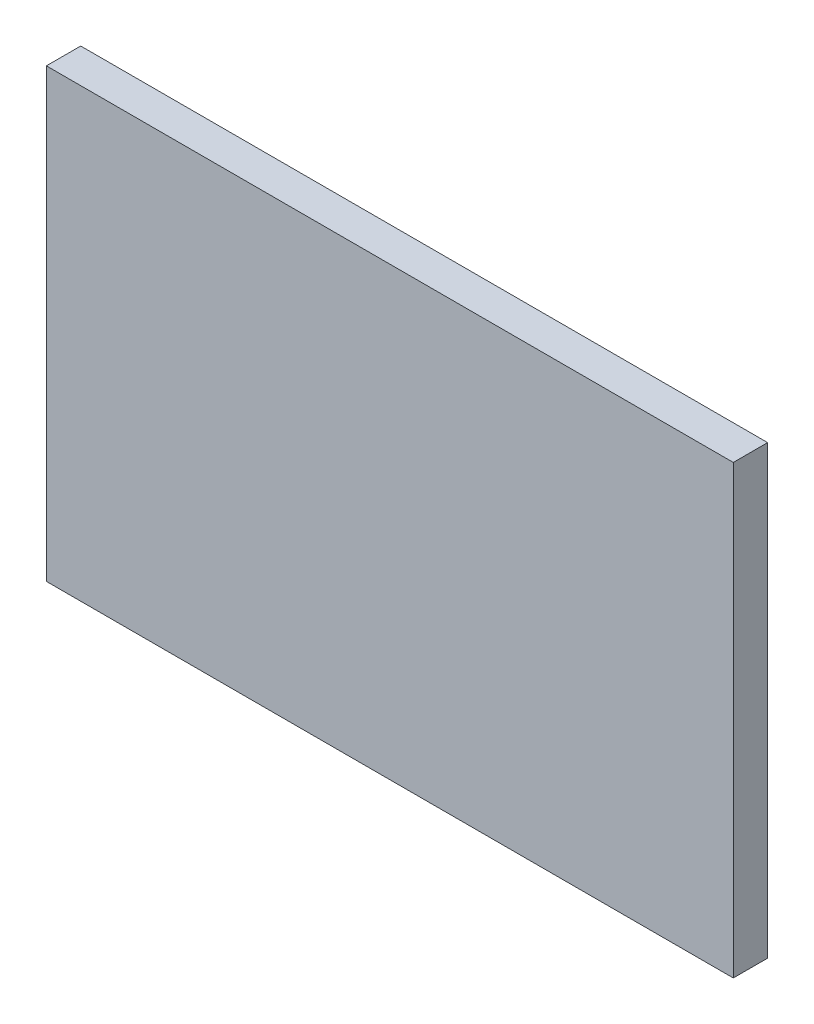
ISO-10303-21;
HEADER;
FILE_DESCRIPTION(('STEP AP214'),'2;1');
FILE_NAME('part.step','',(''),(''),'','','');
FILE_SCHEMA(('AUTOMOTIVE_DESIGN { 1 0 10303 214 1 1 1 1 }'));
ENDSEC;
DATA;
#1=APPLICATION_CONTEXT('core data for automotive mechanical design processes');
#2=APPLICATION_PROTOCOL_DEFINITION('international standard','automotive_design',2000,#1);
#3=PRODUCT_CONTEXT('',#1,'mechanical');
#4=PRODUCT('Part','Part','',(#3));
#5=PRODUCT_RELATED_PRODUCT_CATEGORY('part','',(#4));
#6=PRODUCT_DEFINITION_FORMATION('','',#4);
#7=PRODUCT_DEFINITION_CONTEXT('part definition',#1,'design');
#8=PRODUCT_DEFINITION('design','',#6,#7);
#9=PRODUCT_DEFINITION_SHAPE('','',#8);
#10=(LENGTH_UNIT() NAMED_UNIT(*) SI_UNIT(.MILLI.,.METRE.));
#11=(NAMED_UNIT(*) PLANE_ANGLE_UNIT() SI_UNIT($,.RADIAN.));
#12=(NAMED_UNIT(*) SI_UNIT($,.STERADIAN.) SOLID_ANGLE_UNIT());
#13=UNCERTAINTY_MEASURE_WITH_UNIT(LENGTH_MEASURE(1.E-05),#10,'distance_accuracy_value','');
#14=(GEOMETRIC_REPRESENTATION_CONTEXT(3) GLOBAL_UNCERTAINTY_ASSIGNED_CONTEXT((#13)) GLOBAL_UNIT_ASSIGNED_CONTEXT((#10,
#11,#12)) REPRESENTATION_CONTEXT('',''));
#15=CARTESIAN_POINT('',(0.,0.,0.));
#16=DIRECTION('',(0.,0.,1.));
#17=DIRECTION('',(1.,0.,0.));
#18=AXIS2_PLACEMENT_3D('',#15,#16,#17);
#19=CARTESIAN_POINT('',(0.,0.,0.));
#20=DIRECTION('',(0.,0.,-1.));
#21=DIRECTION('',(-1.,0.,0.));
#22=AXIS2_PLACEMENT_3D('',#19,#20,#21);
#23=PLANE('',#22);
#24=DIRECTION('',(1.,0.,0.));
#25=VECTOR('',#24,1.);
#26=CARTESIAN_POINT('',(-34.,5.,0.));
#27=LINE('',#26,#25);
#28=CARTESIAN_POINT('',(-34.,5.,0.));
#29=VERTEX_POINT('',#28);
#30=CARTESIAN_POINT('',(6.,5.00000000000001,0.));
#31=VERTEX_POINT('',#30);
#32=EDGE_CURVE('E204',#29,#31,#27,.T.);
#33=ORIENTED_EDGE('',*,*,#32,.F.);
#34=DIRECTION('',(0.,1.,0.));
#35=VECTOR('',#34,1.);
#36=CARTESIAN_POINT('',(-34.,5.,0.));
#37=LINE('',#36,#35);
#38=CARTESIAN_POINT('',(-34.,-5.,0.));
#39=VERTEX_POINT('',#38);
#40=EDGE_CURVE('E190',#39,#29,#37,.T.);
#41=ORIENTED_EDGE('',*,*,#40,.F.);
#42=DIRECTION('',(-1.,0.,0.));
#43=VECTOR('',#42,1.);
#44=CARTESIAN_POINT('',(-34.,-5.,0.));
#45=LINE('',#44,#43);
#46=CARTESIAN_POINT('',(6.,-5.00000000000001,0.));
#47=VERTEX_POINT('',#46);
#48=EDGE_CURVE('E195',#47,#39,#45,.T.);
#49=ORIENTED_EDGE('',*,*,#48,.F.);
#50=DIRECTION('',(0.,-1.,0.));
#51=VECTOR('',#50,1.);
#52=CARTESIAN_POINT('',(6.,5.00000000000001,0.));
#53=LINE('',#52,#51);
#54=EDGE_CURVE('E206',#31,#47,#53,.T.);
#55=ORIENTED_EDGE('',*,*,#54,.F.);
#56=EDGE_LOOP('',(#33,#41,#49,#55));
#57=FACE_BOUND('',#56,.T.);
#58=DIRECTION('',(0.,-1.,0.));
#59=VECTOR('',#58,1.);
#60=CARTESIAN_POINT('',(-100.,-50.,0.));
#61=LINE('',#60,#59);
#62=CARTESIAN_POINT('',(-100.,-20.0000000000001,0.));
#63=VERTEX_POINT('',#62);
#64=CARTESIAN_POINT('',(-100.,-65.,0.));
#65=VERTEX_POINT('',#64);
#66=EDGE_CURVE('E221',#63,#65,#61,.T.);
#67=ORIENTED_EDGE('',*,*,#66,.F.);
#68=DIRECTION('',(-1.,0.,0.));
#69=VECTOR('',#68,1.);
#70=CARTESIAN_POINT('',(-90.,-20.,0.));
#71=LINE('',#70,#69);
#72=CARTESIAN_POINT('',(-90.,-20.,0.));
#73=VERTEX_POINT('',#72);
#74=EDGE_CURVE('E180',#73,#63,#71,.T.);
#75=ORIENTED_EDGE('',*,*,#74,.F.);
#76=DIRECTION('',(0.,-1.,0.));
#77=VECTOR('',#76,1.);
#78=CARTESIAN_POINT('',(-90.,-20.,0.));
#79=LINE('',#78,#77);
#80=CARTESIAN_POINT('',(-90.,20.,0.));
#81=VERTEX_POINT('',#80);
#82=EDGE_CURVE('E177',#81,#73,#79,.T.);
#83=ORIENTED_EDGE('',*,*,#82,.F.);
#84=DIRECTION('',(1.,0.,0.));
#85=VECTOR('',#84,1.);
#86=CARTESIAN_POINT('',(-90.,20.,0.));
#87=LINE('',#86,#85);
#88=CARTESIAN_POINT('',(-100.,20.,0.));
#89=VERTEX_POINT('',#88);
#90=EDGE_CURVE('E170',#89,#81,#87,.T.);
#91=ORIENTED_EDGE('',*,*,#90,.F.);
#92=CARTESIAN_POINT('',(-100.,65.,0.));
#93=VERTEX_POINT('',#92);
#94=EDGE_CURVE('E218',#93,#89,#61,.T.);
#95=ORIENTED_EDGE('',*,*,#94,.F.);
#96=DIRECTION('',(-1.,0.,0.));
#97=VECTOR('',#96,1.);
#98=CARTESIAN_POINT('',(100.,65.,0.));
#99=LINE('',#98,#97);
#100=CARTESIAN_POINT('',(100.,65.,0.));
#101=VERTEX_POINT('',#100);
#102=EDGE_CURVE('E146',#101,#93,#99,.T.);
#103=ORIENTED_EDGE('',*,*,#102,.F.);
#104=DIRECTION('',(0.,1.,0.));
#105=VECTOR('',#104,1.);
#106=CARTESIAN_POINT('',(100.,-50.,0.));
#107=LINE('',#106,#105);
#108=CARTESIAN_POINT('',(100.,-65.,0.));
#109=VERTEX_POINT('',#108);
#110=EDGE_CURVE('E217',#109,#101,#107,.T.);
#111=ORIENTED_EDGE('',*,*,#110,.F.);
#112=DIRECTION('',(-1.,0.,0.));
#113=VECTOR('',#112,1.);
#114=CARTESIAN_POINT('',(100.,-65.,0.));
#115=LINE('',#114,#113);
#116=EDGE_CURVE('E147',#109,#65,#115,.T.);
#117=ORIENTED_EDGE('',*,*,#116,.T.);
#118=EDGE_LOOP('',(#67,#75,#83,#91,#95,#103,#111,#117));
#119=FACE_BOUND('',#118,.T.);
#120=ADVANCED_FACE('F33',(#57,#119),#23,.T.);
#121=CARTESIAN_POINT('',(100.,-50.,10.));
#122=DIRECTION('',(-1.,0.,0.));
#123=DIRECTION('',(0.,0.,1.));
#124=AXIS2_PLACEMENT_3D('',#121,#122,#123);
#125=PLANE('',#124);
#126=ORIENTED_EDGE('',*,*,#110,.T.);
#127=DIRECTION('',(0.,0.,-1.));
#128=VECTOR('',#127,1.);
#129=CARTESIAN_POINT('',(100.,65.,10.));
#130=LINE('',#129,#128);
#131=CARTESIAN_POINT('',(100.,65.,10.));
#132=VERTEX_POINT('',#131);
#133=EDGE_CURVE('E141',#132,#101,#130,.T.);
#134=ORIENTED_EDGE('',*,*,#133,.F.);
#135=DIRECTION('',(0.,1.,0.));
#136=VECTOR('',#135,1.);
#137=CARTESIAN_POINT('',(100.,-50.,10.));
#138=LINE('',#137,#136);
#139=CARTESIAN_POINT('',(100.,-65.,10.));
#140=VERTEX_POINT('',#139);
#141=EDGE_CURVE('E42',#140,#132,#138,.T.);
#142=ORIENTED_EDGE('',*,*,#141,.F.);
#143=DIRECTION('',(0.,0.,-1.));
#144=VECTOR('',#143,1.);
#145=CARTESIAN_POINT('',(100.,-65.,10.));
#146=LINE('',#145,#144);
#147=EDGE_CURVE('E150',#140,#109,#146,.T.);
#148=ORIENTED_EDGE('',*,*,#147,.T.);
#149=EDGE_LOOP('',(#126,#134,#142,#148));
#150=FACE_BOUND('',#149,.T.);
#151=ADVANCED_FACE('F35',(#150),#125,.F.);
#152=CARTESIAN_POINT('',(-100.,-50.,10.));
#153=DIRECTION('',(1.,0.,0.));
#154=DIRECTION('',(0.,0.,-1.));
#155=AXIS2_PLACEMENT_3D('',#152,#153,#154);
#156=PLANE('',#155);
#157=ORIENTED_EDGE('',*,*,#94,.T.);
#158=DIRECTION('',(0.,0.,1.));
#159=VECTOR('',#158,1.);
#160=CARTESIAN_POINT('',(-100.,20.,-40.));
#161=LINE('',#160,#159);
#162=CARTESIAN_POINT('',(-100.,20.,-40.));
#163=VERTEX_POINT('',#162);
#164=EDGE_CURVE('E185',#163,#89,#161,.T.);
#165=ORIENTED_EDGE('',*,*,#164,.F.);
#166=DIRECTION('',(0.,1.,0.));
#167=VECTOR('',#166,1.);
#168=CARTESIAN_POINT('',(-100.,20.,-40.));
#169=LINE('',#168,#167);
#170=CARTESIAN_POINT('',(-100.,-20.,-40.));
#171=VERTEX_POINT('',#170);
#172=EDGE_CURVE('E172',#171,#163,#169,.T.);
#173=ORIENTED_EDGE('',*,*,#172,.F.);
#174=DIRECTION('',(0.,0.,1.));
#175=VECTOR('',#174,1.);
#176=CARTESIAN_POINT('',(-100.,-20.,-40.));
#177=LINE('',#176,#175);
#178=EDGE_CURVE('E50',#171,#63,#177,.T.);
#179=ORIENTED_EDGE('',*,*,#178,.T.);
#180=ORIENTED_EDGE('',*,*,#66,.T.);
#181=DIRECTION('',(0.,0.,1.));
#182=VECTOR('',#181,1.);
#183=CARTESIAN_POINT('',(-100.,-65.,0.));
#184=LINE('',#183,#182);
#185=CARTESIAN_POINT('',(-100.,-65.,10.));
#186=VERTEX_POINT('',#185);
#187=EDGE_CURVE('E131',#65,#186,#184,.T.);
#188=ORIENTED_EDGE('',*,*,#187,.T.);
#189=DIRECTION('',(0.,-1.,0.));
#190=VECTOR('',#189,1.);
#191=CARTESIAN_POINT('',(-100.,-50.,10.));
#192=LINE('',#191,#190);
#193=CARTESIAN_POINT('',(-100.,65.,10.));
#194=VERTEX_POINT('',#193);
#195=EDGE_CURVE('E11',#194,#186,#192,.T.);
#196=ORIENTED_EDGE('',*,*,#195,.F.);
#197=DIRECTION('',(0.,0.,1.));
#198=VECTOR('',#197,1.);
#199=CARTESIAN_POINT('',(-100.,65.,0.));
#200=LINE('',#199,#198);
#201=EDGE_CURVE('E129',#93,#194,#200,.T.);
#202=ORIENTED_EDGE('',*,*,#201,.F.);
#203=EDGE_LOOP('',(#157,#165,#173,#179,#180,#188,#196,#202));
#204=FACE_BOUND('',#203,.T.);
#205=CARTESIAN_POINT('',(-100.,0.,-20.));
#206=DIRECTION('',(-1.,0.,0.));
#207=DIRECTION('',(0.,0.,1.));
#208=AXIS2_PLACEMENT_3D('',#205,#206,#207);
#209=CIRCLE('',#208,5.);
#210=CARTESIAN_POINT('',(-100.,0.,-15.));
#211=VERTEX_POINT('',#210);
#212=EDGE_CURVE('E157',#211,#211,#209,.T.);
#213=ORIENTED_EDGE('',*,*,#212,.F.);
#214=EDGE_LOOP('',(#213));
#215=FACE_BOUND('',#214,.T.);
#216=ADVANCED_FACE('F126',(#204,#215),#156,.F.);
#217=CARTESIAN_POINT('',(0.,0.,10.));
#218=DIRECTION('',(0.,0.,-1.));
#219=DIRECTION('',(-1.,0.,0.));
#220=AXIS2_PLACEMENT_3D('',#217,#218,#219);
#221=PLANE('',#220);
#222=ORIENTED_EDGE('',*,*,#141,.T.);
#223=DIRECTION('',(1.,0.,0.));
#224=VECTOR('',#223,1.);
#225=CARTESIAN_POINT('',(-100.,65.,10.));
#226=LINE('',#225,#224);
#227=EDGE_CURVE('E136',#194,#132,#226,.T.);
#228=ORIENTED_EDGE('',*,*,#227,.F.);
#229=ORIENTED_EDGE('',*,*,#195,.T.);
#230=DIRECTION('',(1.,0.,0.));
#231=VECTOR('',#230,1.);
#232=CARTESIAN_POINT('',(-100.,-65.,10.));
#233=LINE('',#232,#231);
#234=EDGE_CURVE('E159',#186,#140,#233,.T.);
#235=ORIENTED_EDGE('',*,*,#234,.T.);
#236=EDGE_LOOP('',(#222,#228,#229,#235));
#237=FACE_BOUND('',#236,.T.);
#238=ADVANCED_FACE('F137',(#237),#221,.F.);
#239=CARTESIAN_POINT('',(-34.,5.,-40.));
#240=DIRECTION('',(1.,0.,0.));
#241=DIRECTION('',(0.,0.,-1.));
#242=AXIS2_PLACEMENT_3D('',#239,#240,#241);
#243=PLANE('',#242);
#244=ORIENTED_EDGE('',*,*,#40,.T.);
#245=DIRECTION('',(0.,0.,1.));
#246=VECTOR('',#245,1.);
#247=CARTESIAN_POINT('',(-34.,5.,-40.));
#248=LINE('',#247,#246);
#249=CARTESIAN_POINT('',(-34.,5.,-40.));
#250=VERTEX_POINT('',#249);
#251=EDGE_CURVE('E215',#250,#29,#248,.T.);
#252=ORIENTED_EDGE('',*,*,#251,.F.);
#253=DIRECTION('',(0.,1.,0.));
#254=VECTOR('',#253,1.);
#255=CARTESIAN_POINT('',(-34.,5.,-40.));
#256=LINE('',#255,#254);
#257=CARTESIAN_POINT('',(-34.,-5.,-40.));
#258=VERTEX_POINT('',#257);
#259=EDGE_CURVE('E191',#258,#250,#256,.T.);
#260=ORIENTED_EDGE('',*,*,#259,.F.);
#261=DIRECTION('',(0.,0.,1.));
#262=VECTOR('',#261,1.);
#263=CARTESIAN_POINT('',(-34.,-5.,-40.));
#264=LINE('',#263,#262);
#265=EDGE_CURVE('E201',#258,#39,#264,.T.);
#266=ORIENTED_EDGE('',*,*,#265,.T.);
#267=EDGE_LOOP('',(#244,#252,#260,#266));
#268=FACE_BOUND('',#267,.T.);
#269=ADVANCED_FACE('F258',(#268),#243,.F.);
#270=CARTESIAN_POINT('',(-34.,5.,-40.));
#271=DIRECTION('',(0.,-1.,0.));
#272=DIRECTION('',(1.,0.,0.));
#273=AXIS2_PLACEMENT_3D('',#270,#271,#272);
#274=PLANE('',#273);
#275=CARTESIAN_POINT('',(-14.,5.00000000000001,-20.));
#276=DIRECTION('',(0.,1.,0.));
#277=DIRECTION('',(-1.,0.,0.));
#278=AXIS2_PLACEMENT_3D('',#275,#276,#277);
#279=CIRCLE('',#278,5.);
#280=CARTESIAN_POINT('',(-19.,5.00000000000001,-20.));
#281=VERTEX_POINT('',#280);
#282=EDGE_CURVE('E153',#281,#281,#279,.T.);
#283=ORIENTED_EDGE('',*,*,#282,.F.);
#284=EDGE_LOOP('',(#283));
#285=FACE_BOUND('',#284,.T.);
#286=ORIENTED_EDGE('',*,*,#32,.T.);
#287=DIRECTION('',(0.,0.,1.));
#288=VECTOR('',#287,1.);
#289=CARTESIAN_POINT('',(6.,5.00000000000001,-40.));
#290=LINE('',#289,#288);
#291=CARTESIAN_POINT('',(6.,5.00000000000001,-40.));
#292=VERTEX_POINT('',#291);
#293=EDGE_CURVE('E212',#292,#31,#290,.T.);
#294=ORIENTED_EDGE('',*,*,#293,.F.);
#295=DIRECTION('',(1.,0.,0.));
#296=VECTOR('',#295,1.);
#297=CARTESIAN_POINT('',(-34.,5.,-40.));
#298=LINE('',#297,#296);
#299=EDGE_CURVE('E194',#250,#292,#298,.T.);
#300=ORIENTED_EDGE('',*,*,#299,.F.);
#301=ORIENTED_EDGE('',*,*,#251,.T.);
#302=EDGE_LOOP('',(#286,#294,#300,#301));
#303=FACE_BOUND('',#302,.T.);
#304=ADVANCED_FACE('F262',(#285,#303),#274,.F.);
#305=CARTESIAN_POINT('',(6.,5.00000000000001,-40.));
#306=DIRECTION('',(-1.,0.,0.));
#307=DIRECTION('',(0.,0.,1.));
#308=AXIS2_PLACEMENT_3D('',#305,#306,#307);
#309=PLANE('',#308);
#310=ORIENTED_EDGE('',*,*,#54,.T.);
#311=DIRECTION('',(0.,0.,1.));
#312=VECTOR('',#311,1.);
#313=CARTESIAN_POINT('',(6.,-5.00000000000001,-40.));
#314=LINE('',#313,#312);
#315=CARTESIAN_POINT('',(6.,-5.00000000000001,-40.));
#316=VERTEX_POINT('',#315);
#317=EDGE_CURVE('E58',#316,#47,#314,.T.);
#318=ORIENTED_EDGE('',*,*,#317,.F.);
#319=DIRECTION('',(0.,-1.,0.));
#320=VECTOR('',#319,1.);
#321=CARTESIAN_POINT('',(6.,5.00000000000001,-40.));
#322=LINE('',#321,#320);
#323=EDGE_CURVE('E197',#292,#316,#322,.T.);
#324=ORIENTED_EDGE('',*,*,#323,.F.);
#325=ORIENTED_EDGE('',*,*,#293,.T.);
#326=EDGE_LOOP('',(#310,#318,#324,#325));
#327=FACE_BOUND('',#326,.T.);
#328=ADVANCED_FACE('F267',(#327),#309,.F.);
#329=CARTESIAN_POINT('',(-34.,-5.,-40.));
#330=DIRECTION('',(0.,1.,0.));
#331=DIRECTION('',(-1.,0.,0.));
#332=AXIS2_PLACEMENT_3D('',#329,#330,#331);
#333=PLANE('',#332);
#334=CARTESIAN_POINT('',(-14.,-5.,-20.));
#335=DIRECTION('',(0.,1.,0.));
#336=DIRECTION('',(-1.,0.,0.));
#337=AXIS2_PLACEMENT_3D('',#334,#335,#336);
#338=CIRCLE('',#337,5.);
#339=CARTESIAN_POINT('',(-19.,-5.,-20.));
#340=VERTEX_POINT('',#339);
#341=EDGE_CURVE('E37',#340,#340,#338,.T.);
#342=ORIENTED_EDGE('',*,*,#341,.T.);
#343=EDGE_LOOP('',(#342));
#344=FACE_BOUND('',#343,.T.);
#345=ORIENTED_EDGE('',*,*,#48,.T.);
#346=ORIENTED_EDGE('',*,*,#265,.F.);
#347=DIRECTION('',(-1.,0.,0.));
#348=VECTOR('',#347,1.);
#349=CARTESIAN_POINT('',(-34.,-5.,-40.));
#350=LINE('',#349,#348);
#351=EDGE_CURVE('E199',#316,#258,#350,.T.);
#352=ORIENTED_EDGE('',*,*,#351,.F.);
#353=ORIENTED_EDGE('',*,*,#317,.T.);
#354=EDGE_LOOP('',(#345,#346,#352,#353));
#355=FACE_BOUND('',#354,.T.);
#356=ADVANCED_FACE('F273',(#344,#355),#333,.F.);
#357=CARTESIAN_POINT('',(0.,0.,-40.));
#358=DIRECTION('',(0.,0.,1.));
#359=DIRECTION('',(1.,0.,0.));
#360=AXIS2_PLACEMENT_3D('',#357,#358,#359);
#361=PLANE('',#360);
#362=ORIENTED_EDGE('',*,*,#259,.T.);
#363=ORIENTED_EDGE('',*,*,#299,.T.);
#364=ORIENTED_EDGE('',*,*,#323,.T.);
#365=ORIENTED_EDGE('',*,*,#351,.T.);
#366=EDGE_LOOP('',(#362,#363,#364,#365));
#367=FACE_BOUND('',#366,.T.);
#368=ADVANCED_FACE('F277',(#367),#361,.F.);
#369=CARTESIAN_POINT('',(-90.,-20.,-40.));
#370=DIRECTION('',(-1.,0.,0.));
#371=DIRECTION('',(0.,-1.,0.));
#372=AXIS2_PLACEMENT_3D('',#369,#370,#371);
#373=PLANE('',#372);
#374=CARTESIAN_POINT('',(-90.,0.,-20.));
#375=DIRECTION('',(-1.,0.,0.));
#376=DIRECTION('',(0.,-1.,0.));
#377=AXIS2_PLACEMENT_3D('',#374,#375,#376);
#378=CIRCLE('',#377,5.);
#379=CARTESIAN_POINT('',(-90.,-5.00000000000005,-20.));
#380=VERTEX_POINT('',#379);
#381=EDGE_CURVE('E165',#380,#380,#378,.T.);
#382=ORIENTED_EDGE('',*,*,#381,.T.);
#383=EDGE_LOOP('',(#382));
#384=FACE_BOUND('',#383,.T.);
#385=ORIENTED_EDGE('',*,*,#82,.T.);
#386=DIRECTION('',(0.,0.,1.));
#387=VECTOR('',#386,1.);
#388=CARTESIAN_POINT('',(-90.,-20.,-40.));
#389=LINE('',#388,#387);
#390=CARTESIAN_POINT('',(-90.,-20.,-40.));
#391=VERTEX_POINT('',#390);
#392=EDGE_CURVE('E188',#391,#73,#389,.T.);
#393=ORIENTED_EDGE('',*,*,#392,.F.);
#394=DIRECTION('',(0.,-1.,0.));
#395=VECTOR('',#394,1.);
#396=CARTESIAN_POINT('',(-90.,-20.,-40.));
#397=LINE('',#396,#395);
#398=CARTESIAN_POINT('',(-90.,20.,-40.));
#399=VERTEX_POINT('',#398);
#400=EDGE_CURVE('E166',#399,#391,#397,.T.);
#401=ORIENTED_EDGE('',*,*,#400,.F.);
#402=DIRECTION('',(0.,0.,1.));
#403=VECTOR('',#402,1.);
#404=CARTESIAN_POINT('',(-90.,20.,-40.));
#405=LINE('',#404,#403);
#406=EDGE_CURVE('E176',#399,#81,#405,.T.);
#407=ORIENTED_EDGE('',*,*,#406,.T.);
#408=EDGE_LOOP('',(#385,#393,#401,#407));
#409=FACE_BOUND('',#408,.T.);
#410=ADVANCED_FACE('F225',(#384,#409),#373,.F.);
#411=CARTESIAN_POINT('',(-90.,-20.,-40.));
#412=DIRECTION('',(0.,1.,0.));
#413=DIRECTION('',(0.,0.,1.));
#414=AXIS2_PLACEMENT_3D('',#411,#412,#413);
#415=PLANE('',#414);
#416=ORIENTED_EDGE('',*,*,#74,.T.);
#417=ORIENTED_EDGE('',*,*,#178,.F.);
#418=DIRECTION('',(-1.,0.,0.));
#419=VECTOR('',#418,1.);
#420=CARTESIAN_POINT('',(-90.,-20.,-40.));
#421=LINE('',#420,#419);
#422=EDGE_CURVE('E169',#391,#171,#421,.T.);
#423=ORIENTED_EDGE('',*,*,#422,.F.);
#424=ORIENTED_EDGE('',*,*,#392,.T.);
#425=EDGE_LOOP('',(#416,#417,#423,#424));
#426=FACE_BOUND('',#425,.T.);
#427=ADVANCED_FACE('F284',(#426),#415,.F.);
#428=CARTESIAN_POINT('',(-90.,20.,-40.));
#429=DIRECTION('',(0.,-1.,0.));
#430=DIRECTION('',(0.,0.,-1.));
#431=AXIS2_PLACEMENT_3D('',#428,#429,#430);
#432=PLANE('',#431);
#433=ORIENTED_EDGE('',*,*,#90,.T.);
#434=ORIENTED_EDGE('',*,*,#406,.F.);
#435=DIRECTION('',(1.,0.,0.));
#436=VECTOR('',#435,1.);
#437=CARTESIAN_POINT('',(-90.,20.,-40.));
#438=LINE('',#437,#436);
#439=EDGE_CURVE('E174',#163,#399,#438,.T.);
#440=ORIENTED_EDGE('',*,*,#439,.F.);
#441=ORIENTED_EDGE('',*,*,#164,.T.);
#442=EDGE_LOOP('',(#433,#434,#440,#441));
#443=FACE_BOUND('',#442,.T.);
#444=ADVANCED_FACE('F240',(#443),#432,.F.);
#445=CARTESIAN_POINT('',(0.,0.,-40.));
#446=DIRECTION('',(0.,0.,1.));
#447=DIRECTION('',(1.,0.,0.));
#448=AXIS2_PLACEMENT_3D('',#445,#446,#447);
#449=PLANE('',#448);
#450=ORIENTED_EDGE('',*,*,#400,.T.);
#451=ORIENTED_EDGE('',*,*,#422,.T.);
#452=ORIENTED_EDGE('',*,*,#172,.T.);
#453=ORIENTED_EDGE('',*,*,#439,.T.);
#454=EDGE_LOOP('',(#450,#451,#452,#453));
#455=FACE_BOUND('',#454,.T.);
#456=ADVANCED_FACE('F231',(#455),#449,.F.);
#457=CARTESIAN_POINT('',(-69.,0.,-20.));
#458=DIRECTION('',(-1.,0.,0.));
#459=DIRECTION('',(0.,0.,1.));
#460=AXIS2_PLACEMENT_3D('',#457,#458,#459);
#461=CYLINDRICAL_SURFACE('',#460,5.);
#462=ORIENTED_EDGE('',*,*,#212,.T.);
#463=EDGE_LOOP('',(#462));
#464=FACE_BOUND('',#463,.T.);
#465=ORIENTED_EDGE('',*,*,#381,.F.);
#466=EDGE_LOOP('',(#465));
#467=FACE_BOUND('',#466,.T.);
#468=ADVANCED_FACE('F228',(#464,#467),#461,.F.);
#469=CARTESIAN_POINT('',(0.,-65.,0.));
#470=DIRECTION('',(0.,1.,0.));
#471=DIRECTION('',(0.,0.,1.));
#472=AXIS2_PLACEMENT_3D('',#469,#470,#471);
#473=PLANE('',#472);
#474=ORIENTED_EDGE('',*,*,#187,.F.);
#475=ORIENTED_EDGE('',*,*,#116,.F.);
#476=ORIENTED_EDGE('',*,*,#147,.F.);
#477=ORIENTED_EDGE('',*,*,#234,.F.);
#478=EDGE_LOOP('',(#474,#475,#476,#477));
#479=FACE_BOUND('',#478,.T.);
#480=ADVANCED_FACE('F230',(#479),#473,.F.);
#481=CARTESIAN_POINT('',(0.,65.,0.));
#482=DIRECTION('',(0.,1.,0.));
#483=DIRECTION('',(0.,0.,1.));
#484=AXIS2_PLACEMENT_3D('',#481,#482,#483);
#485=PLANE('',#484);
#486=ORIENTED_EDGE('',*,*,#201,.T.);
#487=ORIENTED_EDGE('',*,*,#227,.T.);
#488=ORIENTED_EDGE('',*,*,#133,.T.);
#489=ORIENTED_EDGE('',*,*,#102,.T.);
#490=EDGE_LOOP('',(#486,#487,#488,#489));
#491=FACE_BOUND('',#490,.T.);
#492=ADVANCED_FACE('F144',(#491),#485,.T.);
#493=CARTESIAN_POINT('',(-14.0000000000001,-125.,-20.));
#494=DIRECTION('',(0.,1.,0.));
#495=DIRECTION('',(-1.,0.,0.));
#496=AXIS2_PLACEMENT_3D('',#493,#494,#495);
#497=CYLINDRICAL_SURFACE('',#496,5.);
#498=ORIENTED_EDGE('',*,*,#282,.T.);
#499=EDGE_LOOP('',(#498));
#500=FACE_BOUND('',#499,.T.);
#501=ORIENTED_EDGE('',*,*,#341,.F.);
#502=EDGE_LOOP('',(#501));
#503=FACE_BOUND('',#502,.T.);
#504=ADVANCED_FACE('F358',(#500,#503),#497,.F.);
#505=CLOSED_SHELL('',(#120,#151,#216,#238,#269,#304,#328,#356,#368,#410,#427,#444,#456,#468,
#480,#492,#504));
#506=MANIFOLD_SOLID_BREP('B2',#505);
#507=ADVANCED_BREP_SHAPE_REPRESENTATION('',(#18,#506),#14);
#508=SHAPE_DEFINITION_REPRESENTATION(#9,#507);
ENDSEC;
END-ISO-10303-21;
